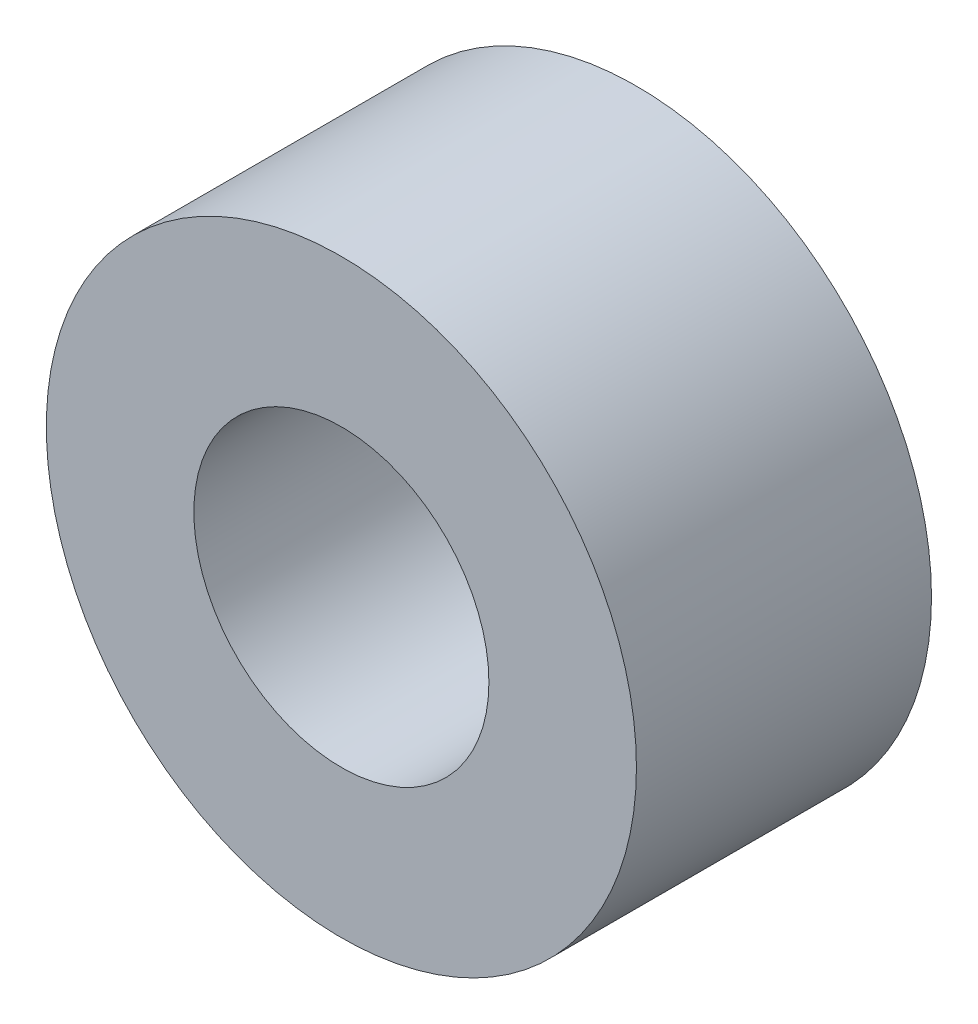
ISO-10303-21;
HEADER;
FILE_DESCRIPTION(('STEP AP214'),'2;1');
FILE_NAME('part.step','',(''),(''),'','','');
FILE_SCHEMA(('AUTOMOTIVE_DESIGN { 1 0 10303 214 1 1 1 1 }'));
ENDSEC;
DATA;
#1=APPLICATION_CONTEXT('core data for automotive mechanical design processes');
#2=APPLICATION_PROTOCOL_DEFINITION('international standard','automotive_design',2000,#1);
#3=PRODUCT_CONTEXT('',#1,'mechanical');
#4=PRODUCT('Part','Part','',(#3));
#5=PRODUCT_RELATED_PRODUCT_CATEGORY('part','',(#4));
#6=PRODUCT_DEFINITION_FORMATION('','',#4);
#7=PRODUCT_DEFINITION_CONTEXT('part definition',#1,'design');
#8=PRODUCT_DEFINITION('design','',#6,#7);
#9=PRODUCT_DEFINITION_SHAPE('','',#8);
#10=(LENGTH_UNIT() NAMED_UNIT(*) SI_UNIT(.MILLI.,.METRE.));
#11=(NAMED_UNIT(*) PLANE_ANGLE_UNIT() SI_UNIT($,.RADIAN.));
#12=(NAMED_UNIT(*) SI_UNIT($,.STERADIAN.) SOLID_ANGLE_UNIT());
#13=UNCERTAINTY_MEASURE_WITH_UNIT(LENGTH_MEASURE(1.E-05),#10,'distance_accuracy_value','');
#14=(GEOMETRIC_REPRESENTATION_CONTEXT(3) GLOBAL_UNCERTAINTY_ASSIGNED_CONTEXT((#13)) GLOBAL_UNIT_ASSIGNED_CONTEXT((#10,
#11,#12)) REPRESENTATION_CONTEXT('',''));
#15=CARTESIAN_POINT('',(0.,0.,0.));
#16=DIRECTION('',(0.,0.,1.));
#17=DIRECTION('',(1.,0.,0.));
#18=AXIS2_PLACEMENT_3D('',#15,#16,#17);
#19=CARTESIAN_POINT('',(0.,0.,5.));
#20=DIRECTION('',(0.,0.,-1.));
#21=DIRECTION('',(-1.,0.,0.));
#22=AXIS2_PLACEMENT_3D('',#19,#20,#21);
#23=CYLINDRICAL_SURFACE('',#22,5.);
#24=CARTESIAN_POINT('',(0.,0.,5.));
#25=DIRECTION('',(0.,0.,1.));
#26=DIRECTION('',(1.,0.,0.));
#27=AXIS2_PLACEMENT_3D('',#24,#25,#26);
#28=CIRCLE('',#27,5.);
#29=CARTESIAN_POINT('',(5.,0.,5.));
#30=VERTEX_POINT('',#29);
#31=EDGE_CURVE('E10',#30,#30,#28,.T.);
#32=ORIENTED_EDGE('',*,*,#31,.F.);
#33=EDGE_LOOP('',(#32));
#34=FACE_BOUND('',#33,.T.);
#35=CARTESIAN_POINT('',(0.,0.,0.));
#36=DIRECTION('',(0.,0.,1.));
#37=DIRECTION('',(1.,0.,0.));
#38=AXIS2_PLACEMENT_3D('',#35,#36,#37);
#39=CIRCLE('',#38,5.);
#40=CARTESIAN_POINT('',(5.,0.,0.));
#41=VERTEX_POINT('',#40);
#42=EDGE_CURVE('E36',#41,#41,#39,.T.);
#43=ORIENTED_EDGE('',*,*,#42,.T.);
#44=EDGE_LOOP('',(#43));
#45=FACE_BOUND('',#44,.T.);
#46=ADVANCED_FACE('F33',(#34,#45),#23,.T.);
#47=CARTESIAN_POINT('',(0.,0.,5.));
#48=DIRECTION('',(0.,0.,1.));
#49=DIRECTION('',(1.,0.,0.));
#50=AXIS2_PLACEMENT_3D('',#47,#48,#49);
#51=PLANE('',#50);
#52=CARTESIAN_POINT('',(0.,0.,5.));
#53=DIRECTION('',(0.,0.,1.));
#54=DIRECTION('',(1.,0.,0.));
#55=AXIS2_PLACEMENT_3D('',#52,#53,#54);
#56=CIRCLE('',#55,2.5);
#57=CARTESIAN_POINT('',(2.5,0.,5.));
#58=VERTEX_POINT('',#57);
#59=EDGE_CURVE('E47',#58,#58,#56,.T.);
#60=ORIENTED_EDGE('',*,*,#59,.F.);
#61=EDGE_LOOP('',(#60));
#62=FACE_BOUND('',#61,.T.);
#63=ORIENTED_EDGE('',*,*,#31,.T.);
#64=EDGE_LOOP('',(#63));
#65=FACE_BOUND('',#64,.T.);
#66=ADVANCED_FACE('F53',(#62,#65),#51,.T.);
#67=CARTESIAN_POINT('',(0.,0.,0.));
#68=DIRECTION('',(0.,0.,1.));
#69=DIRECTION('',(1.,0.,0.));
#70=AXIS2_PLACEMENT_3D('',#67,#68,#69);
#71=PLANE('',#70);
#72=CARTESIAN_POINT('',(0.,0.,0.));
#73=DIRECTION('',(0.,0.,1.));
#74=DIRECTION('',(1.,0.,0.));
#75=AXIS2_PLACEMENT_3D('',#72,#73,#74);
#76=CIRCLE('',#75,2.5);
#77=CARTESIAN_POINT('',(2.5,0.,0.));
#78=VERTEX_POINT('',#77);
#79=EDGE_CURVE('E43',#78,#78,#76,.T.);
#80=ORIENTED_EDGE('',*,*,#79,.T.);
#81=EDGE_LOOP('',(#80));
#82=FACE_BOUND('',#81,.T.);
#83=ORIENTED_EDGE('',*,*,#42,.F.);
#84=EDGE_LOOP('',(#83));
#85=FACE_BOUND('',#84,.T.);
#86=ADVANCED_FACE('F55',(#82,#85),#71,.F.);
#87=CARTESIAN_POINT('',(0.,0.,5.));
#88=DIRECTION('',(0.,0.,1.));
#89=DIRECTION('',(1.,0.,0.));
#90=AXIS2_PLACEMENT_3D('',#87,#88,#89);
#91=CYLINDRICAL_SURFACE('',#90,2.5);
#92=ORIENTED_EDGE('',*,*,#79,.F.);
#93=EDGE_LOOP('',(#92));
#94=FACE_BOUND('',#93,.T.);
#95=ORIENTED_EDGE('',*,*,#59,.T.);
#96=EDGE_LOOP('',(#95));
#97=FACE_BOUND('',#96,.T.);
#98=ADVANCED_FACE('F51',(#94,#97),#91,.F.);
#99=CLOSED_SHELL('',(#46,#66,#86,#98));
#100=MANIFOLD_SOLID_BREP('B2',#99);
#101=ADVANCED_BREP_SHAPE_REPRESENTATION('',(#18,#100),#14);
#102=SHAPE_DEFINITION_REPRESENTATION(#9,#101);
ENDSEC;
END-ISO-10303-21;
